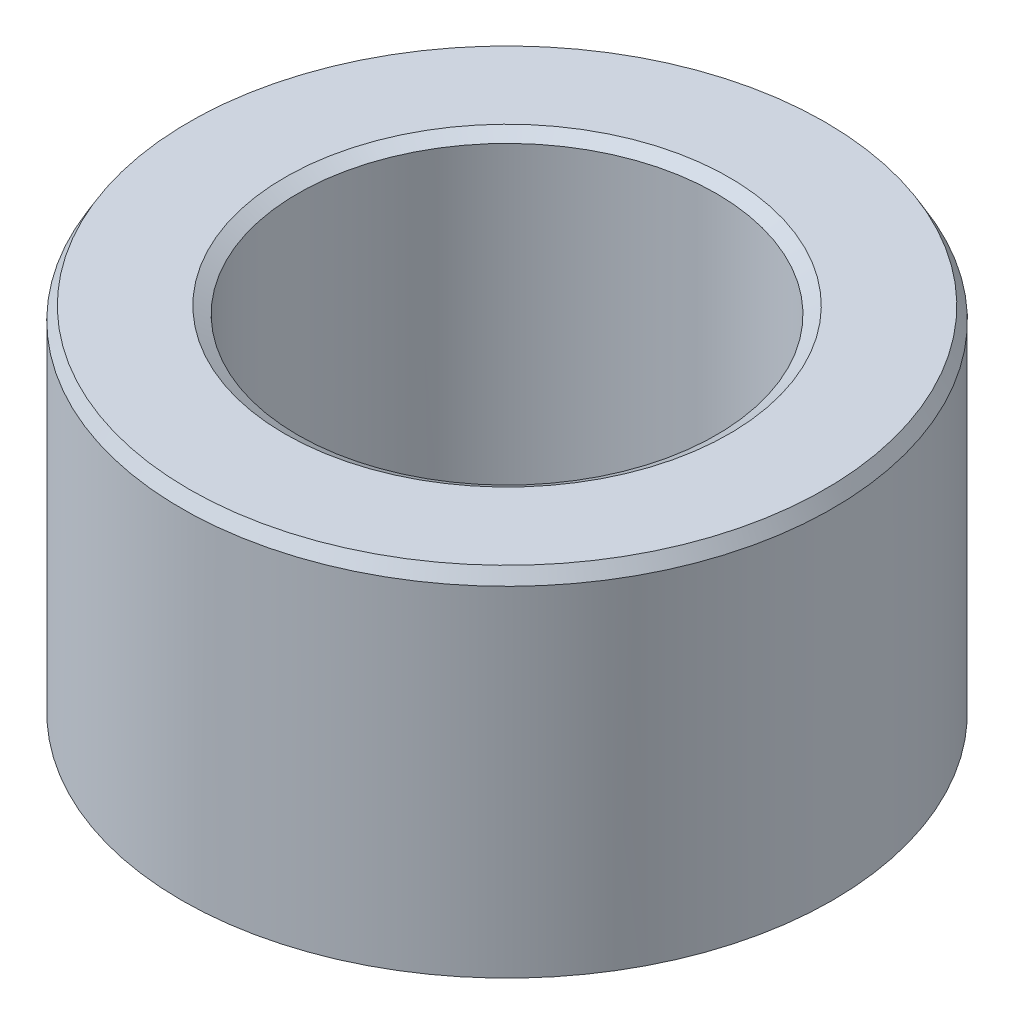
ISO-10303-21;
HEADER;
FILE_DESCRIPTION(('STEP AP214'),'2;1');
FILE_NAME('part.step','',(''),(''),'','','');
FILE_SCHEMA(('AUTOMOTIVE_DESIGN { 1 0 10303 214 1 1 1 1 }'));
ENDSEC;
DATA;
#1=APPLICATION_CONTEXT('core data for automotive mechanical design processes');
#2=APPLICATION_PROTOCOL_DEFINITION('international standard','automotive_design',2000,#1);
#3=PRODUCT_CONTEXT('',#1,'mechanical');
#4=PRODUCT('Part','Part','',(#3));
#5=PRODUCT_RELATED_PRODUCT_CATEGORY('part','',(#4));
#6=PRODUCT_DEFINITION_FORMATION('','',#4);
#7=PRODUCT_DEFINITION_CONTEXT('part definition',#1,'design');
#8=PRODUCT_DEFINITION('design','',#6,#7);
#9=PRODUCT_DEFINITION_SHAPE('','',#8);
#10=(LENGTH_UNIT() NAMED_UNIT(*) SI_UNIT(.MILLI.,.METRE.));
#11=(NAMED_UNIT(*) PLANE_ANGLE_UNIT() SI_UNIT($,.RADIAN.));
#12=(NAMED_UNIT(*) SI_UNIT($,.STERADIAN.) SOLID_ANGLE_UNIT());
#13=UNCERTAINTY_MEASURE_WITH_UNIT(LENGTH_MEASURE(1.E-05),#10,'distance_accuracy_value','');
#14=(GEOMETRIC_REPRESENTATION_CONTEXT(3) GLOBAL_UNCERTAINTY_ASSIGNED_CONTEXT((#13)) GLOBAL_UNIT_ASSIGNED_CONTEXT((#10,
#11,#12)) REPRESENTATION_CONTEXT('',''));
#15=CARTESIAN_POINT('',(0.,0.,0.));
#16=DIRECTION('',(0.,0.,1.));
#17=DIRECTION('',(1.,0.,0.));
#18=AXIS2_PLACEMENT_3D('',#15,#16,#17);
#19=CARTESIAN_POINT('',(0.,33.1529175196933,0.));
#20=DIRECTION('',(0.,-1.,0.));
#21=DIRECTION('',(0.,0.,-1.));
#22=AXIS2_PLACEMENT_3D('',#19,#20,#21);
#23=CYLINDRICAL_SURFACE('',#22,30.);
#24=CARTESIAN_POINT('',(0.,0.688393623580863,0.));
#25=DIRECTION('',(0.,1.,0.));
#26=DIRECTION('',(0.,0.,1.));
#27=AXIS2_PLACEMENT_3D('',#24,#25,#26);
#28=CIRCLE('',#27,30.);
#29=CARTESIAN_POINT('',(0.,0.688393623580863,-30.));
#30=VERTEX_POINT('',#29);
#31=EDGE_CURVE('E10',#30,#30,#28,.T.);
#32=CARTESIAN_POINT('',(0.,31.960584788045,0.));
#33=DIRECTION('',(0.,1.,0.));
#34=DIRECTION('',(0.,0.,1.));
#35=AXIS2_PLACEMENT_3D('',#32,#33,#34);
#36=CIRCLE('',#35,30.);
#37=CARTESIAN_POINT('',(0.,31.960584788045,-30.));
#38=VERTEX_POINT('',#37);
#39=EDGE_CURVE('E50',#38,#38,#36,.F.);
#40=CARTESIAN_POINT('',(0.,0.688393623580863,-30.));
#41=CARTESIAN_POINT('',(0.,1.01414561487737,-30.));
#42=CARTESIAN_POINT('',(0.,1.33989760617387,-30.));
#43=CARTESIAN_POINT('',(0.,1.99140158876687,-30.));
#44=CARTESIAN_POINT('',(0.,2.31715358006337,-30.));
#45=CARTESIAN_POINT('',(0.,2.96865756265637,-30.));
#46=CARTESIAN_POINT('',(0.,3.29440955395287,-30.));
#47=CARTESIAN_POINT('',(0.,3.94591353654588,-30.));
#48=CARTESIAN_POINT('',(0.,4.27166552784238,-30.));
#49=CARTESIAN_POINT('',(0.,4.92316951043538,-30.));
#50=CARTESIAN_POINT('',(0.,5.24892150173188,-30.));
#51=CARTESIAN_POINT('',(0.,5.90042548432488,-30.));
#52=CARTESIAN_POINT('',(0.,6.22617747562139,-30.));
#53=CARTESIAN_POINT('',(0.,6.87768145821439,-30.));
#54=CARTESIAN_POINT('',(0.,7.20343344951089,-30.));
#55=CARTESIAN_POINT('',(0.,7.85493743210389,-30.));
#56=CARTESIAN_POINT('',(0.,8.18068942340039,-30.));
#57=CARTESIAN_POINT('',(0.,8.8321934059934,-30.));
#58=CARTESIAN_POINT('',(0.,9.1579453972899,-30.));
#59=CARTESIAN_POINT('',(0.,9.8094493798829,-30.));
#60=CARTESIAN_POINT('',(0.,10.1352013711794,-30.));
#61=CARTESIAN_POINT('',(0.,10.7867053537724,-30.));
#62=CARTESIAN_POINT('',(0.,11.1124573450689,-30.));
#63=CARTESIAN_POINT('',(0.,11.7639613276619,-30.));
#64=CARTESIAN_POINT('',(0.,12.0897133189584,-30.));
#65=CARTESIAN_POINT('',(0.,12.7412173015514,-30.));
#66=CARTESIAN_POINT('',(0.,13.0669692928479,-30.));
#67=CARTESIAN_POINT('',(0.,13.7184732754409,-30.));
#68=CARTESIAN_POINT('',(0.,14.0442252667374,-30.));
#69=CARTESIAN_POINT('',(0.,14.6957292493304,-30.));
#70=CARTESIAN_POINT('',(0.,15.0214812406269,-30.));
#71=CARTESIAN_POINT('',(0.,15.6729852232199,-30.));
#72=CARTESIAN_POINT('',(0.,15.9987372145164,-30.));
#73=CARTESIAN_POINT('',(0.,16.6502411971094,-30.));
#74=CARTESIAN_POINT('',(0.,16.9759931884059,-30.));
#75=CARTESIAN_POINT('',(0.,17.6274971709989,-30.));
#76=CARTESIAN_POINT('',(0.,17.9532491622954,-30.));
#77=CARTESIAN_POINT('',(0.,18.6047531448884,-30.));
#78=CARTESIAN_POINT('',(0.,18.9305051361849,-30.));
#79=CARTESIAN_POINT('',(0.,19.5820091187779,-30.));
#80=CARTESIAN_POINT('',(0.,19.9077611100744,-30.));
#81=CARTESIAN_POINT('',(0.,20.5592650926674,-30.));
#82=CARTESIAN_POINT('',(0.,20.8850170839639,-30.));
#83=CARTESIAN_POINT('',(0.,21.536521066557,-30.));
#84=CARTESIAN_POINT('',(0.,21.8622730578535,-30.));
#85=CARTESIAN_POINT('',(0.,22.5137770404465,-30.));
#86=CARTESIAN_POINT('',(0.,22.839529031743,-30.));
#87=CARTESIAN_POINT('',(0.,23.491033014336,-30.));
#88=CARTESIAN_POINT('',(0.,23.8167850056325,-30.));
#89=CARTESIAN_POINT('',(0.,24.4682889882255,-30.));
#90=CARTESIAN_POINT('',(0.,24.794040979522,-30.));
#91=CARTESIAN_POINT('',(0.,25.445544962115,-30.));
#92=CARTESIAN_POINT('',(0.,25.7712969534115,-30.));
#93=CARTESIAN_POINT('',(0.,26.4228009360045,-30.));
#94=CARTESIAN_POINT('',(0.,26.748552927301,-30.));
#95=CARTESIAN_POINT('',(0.,27.400056909894,-30.));
#96=CARTESIAN_POINT('',(0.,27.7258089011905,-30.));
#97=CARTESIAN_POINT('',(0.,28.3773128837835,-30.));
#98=CARTESIAN_POINT('',(0.,28.70306487508,-30.));
#99=CARTESIAN_POINT('',(0.,29.354568857673,-30.));
#100=CARTESIAN_POINT('',(0.,29.6803208489695,-30.));
#101=CARTESIAN_POINT('',(0.,30.3318248315625,-30.));
#102=CARTESIAN_POINT('',(0.,30.657576822859,-30.));
#103=CARTESIAN_POINT('',(0.,31.309080805452,-30.));
#104=CARTESIAN_POINT('',(0.,31.6348327967485,-30.));
#105=CARTESIAN_POINT('',(0.,31.960584788045,-30.));
#106=B_SPLINE_CURVE_WITH_KNOTS('',3,(#40,#41,#42,#43,#44,#45,#46,#47,#48,#49,#50,#51,#52,#53,
#54,#55,#56,#57,#58,#59,#60,#61,#62,#63,#64,#65,#66,#67,#68,#69,#70,#71,#72,#73,#74,#75,#76,#77,
#78,#79,#80,#81,#82,#83,#84,#85,#86,#87,#88,#89,#90,#91,#92,#93,#94,#95,#96,#97,#98,#99,#100,
#101,#102,#103,#104,#105),.UNSPECIFIED.,.F.,.F.,(4,2,2,2,2,2,2,2,2,2,2,2,2,2,2,2,2,2,2,2,2,2,2,
2,2,2,2,2,2,2,2,2,4),(0.,0.977255973889507,1.954511947779,2.93176792166851,3.90902389555801,
4.88627986944752,5.86353584333702,6.84079181722653,7.81804779111603,8.79530376500554,
9.77255973889504,10.7498157127845,11.727071686674,12.7043276605636,13.6815836344531,
14.6588396083426,15.6360955822321,16.6133515561216,17.5906075300111,18.5678635039006,
19.5451194777901,20.5223754516796,21.4996314255691,22.4768873994586,23.4541433733481,
24.4313993472376,25.4086553211271,26.3859112950166,27.3631672689061,28.3404232427956,
29.3176792166851,30.2949351905746,31.2721911644641),.UNSPECIFIED.);
#107=EDGE_CURVE('BSEAM39',#30,#38,#106,.T.);
#108=ORIENTED_EDGE('',*,*,#31,.T.);
#109=ORIENTED_EDGE('',*,*,#39,.T.);
#110=ORIENTED_EDGE('',*,*,#107,.T.);
#111=ORIENTED_EDGE('',*,*,#107,.F.);
#112=EDGE_LOOP('',(#108,#110,#109,#111));
#113=FACE_BOUND('',#112,.T.);
#114=ADVANCED_FACE('F39',(#113),#23,.T.);
#115=CARTESIAN_POINT('',(0.,33.1529175196933,0.));
#116=DIRECTION('',(0.,1.,0.));
#117=DIRECTION('',(0.,0.,1.));
#118=AXIS2_PLACEMENT_3D('',#115,#116,#117);
#119=PLANE('',#118);
#120=CARTESIAN_POINT('',(0.,33.1529175196933,0.));
#121=DIRECTION('',(0.,1.,0.));
#122=DIRECTION('',(0.,0.,1.));
#123=AXIS2_PLACEMENT_3D('',#120,#121,#122);
#124=CIRCLE('',#123,20.4785011570187);
#125=CARTESIAN_POINT('',(0.,33.1529175196933,20.4785011570187));
#126=VERTEX_POINT('',#125);
#127=EDGE_CURVE('E58',#126,#126,#124,.F.);
#128=ORIENTED_EDGE('',*,*,#127,.T.);
#129=EDGE_LOOP('',(#128));
#130=FACE_BOUND('',#129,.T.);
#131=CARTESIAN_POINT('',(0.,33.1529175196933,0.));
#132=DIRECTION('',(0.,1.,0.));
#133=DIRECTION('',(0.,0.,1.));
#134=AXIS2_PLACEMENT_3D('',#131,#132,#133);
#135=CIRCLE('',#134,29.3116063764192);
#136=CARTESIAN_POINT('',(0.,33.1529175196933,29.3116063764192));
#137=VERTEX_POINT('',#136);
#138=EDGE_CURVE('E61',#137,#137,#135,.T.);
#139=ORIENTED_EDGE('',*,*,#138,.T.);
#140=EDGE_LOOP('',(#139));
#141=FACE_BOUND('',#140,.T.);
#142=ADVANCED_FACE('F88',(#130,#141),#119,.T.);
#143=CARTESIAN_POINT('',(0.,0.,0.));
#144=DIRECTION('',(0.,1.,0.));
#145=DIRECTION('',(0.,0.,1.));
#146=AXIS2_PLACEMENT_3D('',#143,#144,#145);
#147=PLANE('',#146);
#148=CARTESIAN_POINT('',(0.,0.,0.));
#149=DIRECTION('',(0.,1.,0.));
#150=DIRECTION('',(0.,0.,1.));
#151=AXIS2_PLACEMENT_3D('',#148,#149,#150);
#152=CIRCLE('',#151,19.974562048951);
#153=CARTESIAN_POINT('',(0.,0.,19.974562048951));
#154=VERTEX_POINT('',#153);
#155=EDGE_CURVE('E51',#154,#154,#152,.T.);
#156=ORIENTED_EDGE('',*,*,#155,.T.);
#157=EDGE_LOOP('',(#156));
#158=FACE_BOUND('',#157,.T.);
#159=CARTESIAN_POINT('',(0.,0.,0.));
#160=DIRECTION('',(0.,1.,0.));
#161=DIRECTION('',(0.,0.,1.));
#162=AXIS2_PLACEMENT_3D('',#159,#160,#161);
#163=CIRCLE('',#162,28.8076672683515);
#164=CARTESIAN_POINT('',(0.,0.,28.8076672683515));
#165=VERTEX_POINT('',#164);
#166=EDGE_CURVE('E54',#165,#165,#163,.F.);
#167=ORIENTED_EDGE('',*,*,#166,.T.);
#168=EDGE_LOOP('',(#167));
#169=FACE_BOUND('',#168,.T.);
#170=ADVANCED_FACE('F83',(#158,#169),#147,.F.);
#171=CARTESIAN_POINT('',(0.,33.1529175196933,0.));
#172=DIRECTION('',(0.,-1.,0.));
#173=DIRECTION('',(0.,0.,-1.));
#174=AXIS2_PLACEMENT_3D('',#171,#172,#173);
#175=CYLINDRICAL_SURFACE('',#174,19.2861684253702);
#176=CARTESIAN_POINT('',(0.,32.4645238961125,0.));
#177=DIRECTION('',(0.,1.,0.));
#178=DIRECTION('',(0.,0.,1.));
#179=AXIS2_PLACEMENT_3D('',#176,#177,#178);
#180=CIRCLE('',#179,19.2861684253702);
#181=CARTESIAN_POINT('',(0.,32.4645238961125,-19.2861684253702));
#182=VERTEX_POINT('',#181);
#183=EDGE_CURVE('E67',#182,#182,#180,.T.);
#184=CARTESIAN_POINT('',(0.,1.19233273164838,0.));
#185=DIRECTION('',(0.,1.,0.));
#186=DIRECTION('',(0.,0.,1.));
#187=AXIS2_PLACEMENT_3D('',#184,#185,#186);
#188=CIRCLE('',#187,19.2861684253702);
#189=CARTESIAN_POINT('',(0.,1.19233273164837,-19.2861684253702));
#190=VERTEX_POINT('',#189);
#191=EDGE_CURVE('E69',#190,#190,#188,.F.);
#192=CARTESIAN_POINT('',(0.,32.4645238961125,-19.2861684253702));
#193=CARTESIAN_POINT('',(0.,32.1387719048159,-19.2861684253702));
#194=CARTESIAN_POINT('',(0.,31.8130199135195,-19.2861684253702));
#195=CARTESIAN_POINT('',(0.,31.1615159309265,-19.2861684253702));
#196=CARTESIAN_POINT('',(0.,30.8357639396299,-19.2861684253702));
#197=CARTESIAN_POINT('',(0.,30.1842599570369,-19.2861684253702));
#198=CARTESIAN_POINT('',(0.,29.8585079657404,-19.2861684253702));
#199=CARTESIAN_POINT('',(0.,29.2070039831474,-19.2861684253702));
#200=CARTESIAN_POINT('',(0.,28.8812519918509,-19.2861684253702));
#201=CARTESIAN_POINT('',(0.,28.2297480092579,-19.2861684253702));
#202=CARTESIAN_POINT('',(0.,27.9039960179614,-19.2861684253702));
#203=CARTESIAN_POINT('',(0.,27.2524920353684,-19.2861684253702));
#204=CARTESIAN_POINT('',(0.,26.9267400440719,-19.2861684253702));
#205=CARTESIAN_POINT('',(0.,26.2752360614789,-19.2861684253702));
#206=CARTESIAN_POINT('',(0.,25.9494840701824,-19.2861684253702));
#207=CARTESIAN_POINT('',(0.,25.2979800875894,-19.2861684253702));
#208=CARTESIAN_POINT('',(0.,24.9722280962929,-19.2861684253702));
#209=CARTESIAN_POINT('',(0.,24.3207241136999,-19.2861684253702));
#210=CARTESIAN_POINT('',(0.,23.9949721224034,-19.2861684253702));
#211=CARTESIAN_POINT('',(0.,23.3434681398104,-19.2861684253702));
#212=CARTESIAN_POINT('',(0.,23.0177161485139,-19.2861684253702));
#213=CARTESIAN_POINT('',(0.,22.3662121659209,-19.2861684253702));
#214=CARTESIAN_POINT('',(0.,22.0404601746244,-19.2861684253702));
#215=CARTESIAN_POINT('',(0.,21.3889561920314,-19.2861684253702));
#216=CARTESIAN_POINT('',(0.,21.0632042007349,-19.2861684253702));
#217=CARTESIAN_POINT('',(0.,20.4117002181419,-19.2861684253702));
#218=CARTESIAN_POINT('',(0.,20.0859482268454,-19.2861684253702));
#219=CARTESIAN_POINT('',(0.,19.4344442442524,-19.2861684253702));
#220=CARTESIAN_POINT('',(0.,19.1086922529559,-19.2861684253702));
#221=CARTESIAN_POINT('',(0.,18.4571882703629,-19.2861684253702));
#222=CARTESIAN_POINT('',(0.,18.1314362790664,-19.2861684253702));
#223=CARTESIAN_POINT('',(0.,17.4799322964734,-19.2861684253702));
#224=CARTESIAN_POINT('',(0.,17.1541803051769,-19.2861684253702));
#225=CARTESIAN_POINT('',(0.,16.5026763225839,-19.2861684253702));
#226=CARTESIAN_POINT('',(0.,16.1769243312874,-19.2861684253702));
#227=CARTESIAN_POINT('',(0.,15.5254203486944,-19.2861684253702));
#228=CARTESIAN_POINT('',(0.,15.1996683573979,-19.2861684253702));
#229=CARTESIAN_POINT('',(0.,14.5481643748049,-19.2861684253702));
#230=CARTESIAN_POINT('',(0.,14.2224123835084,-19.2861684253702));
#231=CARTESIAN_POINT('',(0.,13.5709084009154,-19.2861684253702));
#232=CARTESIAN_POINT('',(0.,13.2451564096189,-19.2861684253702));
#233=CARTESIAN_POINT('',(0.,12.5936524270259,-19.2861684253702));
#234=CARTESIAN_POINT('',(0.,12.2679004357294,-19.2861684253702));
#235=CARTESIAN_POINT('',(0.,11.6163964531364,-19.2861684253702));
#236=CARTESIAN_POINT('',(0.,11.2906444618399,-19.2861684253702));
#237=CARTESIAN_POINT('',(0.,10.6391404792469,-19.2861684253702));
#238=CARTESIAN_POINT('',(0.,10.3133884879504,-19.2861684253702));
#239=CARTESIAN_POINT('',(0.,9.6618845053574,-19.2861684253702));
#240=CARTESIAN_POINT('',(0.,9.33613251406089,-19.2861684253702));
#241=CARTESIAN_POINT('',(0.,8.68462853146789,-19.2861684253702));
#242=CARTESIAN_POINT('',(0.,8.35887654017139,-19.2861684253702));
#243=CARTESIAN_POINT('',(0.,7.70737255757839,-19.2861684253702));
#244=CARTESIAN_POINT('',(0.,7.38162056628189,-19.2861684253702));
#245=CARTESIAN_POINT('',(0.,6.73011658368889,-19.2861684253702));
#246=CARTESIAN_POINT('',(0.,6.40436459239239,-19.2861684253702));
#247=CARTESIAN_POINT('',(0.,5.75286060979938,-19.2861684253702));
#248=CARTESIAN_POINT('',(0.,5.42710861850288,-19.2861684253702));
#249=CARTESIAN_POINT('',(0.,4.77560463590988,-19.2861684253702));
#250=CARTESIAN_POINT('',(0.,4.44985264461338,-19.2861684253702));
#251=CARTESIAN_POINT('',(0.,3.79834866202038,-19.2861684253702));
#252=CARTESIAN_POINT('',(0.,3.47259667072388,-19.2861684253702));
#253=CARTESIAN_POINT('',(0.,2.82109268813088,-19.2861684253702));
#254=CARTESIAN_POINT('',(0.,2.49534069683438,-19.2861684253702));
#255=CARTESIAN_POINT('',(0.,1.84383671424137,-19.2861684253702));
#256=CARTESIAN_POINT('',(0.,1.51808472294487,-19.2861684253702));
#257=CARTESIAN_POINT('',(0.,1.19233273164837,-19.2861684253702));
#258=B_SPLINE_CURVE_WITH_KNOTS('',3,(#192,#193,#194,#195,#196,#197,#198,#199,#200,#201,#202,
#203,#204,#205,#206,#207,#208,#209,#210,#211,#212,#213,#214,#215,#216,#217,#218,#219,#220,#221,
#222,#223,#224,#225,#226,#227,#228,#229,#230,#231,#232,#233,#234,#235,#236,#237,#238,#239,#240,
#241,#242,#243,#244,#245,#246,#247,#248,#249,#250,#251,#252,#253,#254,#255,#256,#257),
.UNSPECIFIED.,.F.,.F.,(4,2,2,2,2,2,2,2,2,2,2,2,2,2,2,2,2,2,2,2,2,2,2,2,2,2,2,2,2,2,2,2,4),(0.,
0.9772559738895,1.954511947779,2.9317679216685,3.90902389555801,4.88627986944751,
5.86353584333701,6.84079181722651,7.81804779111601,8.79530376500552,9.77255973889502,
10.7498157127845,11.727071686674,12.7043276605635,13.681583634453,14.6588396083425,
15.636095582232,16.6133515561215,17.590607530011,18.5678635039005,19.54511947779,
20.5223754516796,21.499631425569,22.4768873994586,23.4541433733481,24.4313993472376,
25.4086553211271,26.3859112950166,27.3631672689061,28.3404232427956,29.3176792166851,
30.2949351905746,31.2721911644641),.UNSPECIFIED.);
#259=EDGE_CURVE('BSEAM71',#182,#190,#258,.T.);
#260=ORIENTED_EDGE('',*,*,#183,.T.);
#261=ORIENTED_EDGE('',*,*,#191,.T.);
#262=ORIENTED_EDGE('',*,*,#259,.T.);
#263=ORIENTED_EDGE('',*,*,#259,.F.);
#264=EDGE_LOOP('',(#260,#262,#261,#263));
#265=FACE_BOUND('',#264,.T.);
#266=ADVANCED_FACE('F71',(#265),#175,.F.);
#267=CARTESIAN_POINT('',(0.,32.4645238961125,0.));
#268=DIRECTION('',(0.,1.,0.));
#269=DIRECTION('',(0.,0.,1.));
#270=AXIS2_PLACEMENT_3D('',#267,#268,#269);
#271=CONICAL_SURFACE('',#270,19.2861684253702,1.0471975511966);
#272=ORIENTED_EDGE('',*,*,#127,.F.);
#273=EDGE_LOOP('',(#272));
#274=FACE_BOUND('',#273,.T.);
#275=ORIENTED_EDGE('',*,*,#183,.F.);
#276=EDGE_LOOP('',(#275));
#277=FACE_BOUND('',#276,.T.);
#278=ADVANCED_FACE('F77',(#274,#277),#271,.F.);
#279=CARTESIAN_POINT('',(0.,0.,0.));
#280=DIRECTION('',(0.,-1.,0.));
#281=DIRECTION('',(0.,0.,-1.));
#282=AXIS2_PLACEMENT_3D('',#279,#280,#281);
#283=CONICAL_SURFACE('',#282,19.974562048951,0.523598775598299);
#284=ORIENTED_EDGE('',*,*,#191,.F.);
#285=EDGE_LOOP('',(#284));
#286=FACE_BOUND('',#285,.T.);
#287=ORIENTED_EDGE('',*,*,#155,.F.);
#288=EDGE_LOOP('',(#287));
#289=FACE_BOUND('',#288,.T.);
#290=ADVANCED_FACE('F73',(#286,#289),#283,.F.);
#291=CARTESIAN_POINT('',(0.,0.688393623580856,0.));
#292=DIRECTION('',(0.,1.,0.));
#293=DIRECTION('',(0.,0.,1.));
#294=AXIS2_PLACEMENT_3D('',#291,#292,#293);
#295=CONICAL_SURFACE('',#294,30.,1.0471975511966);
#296=ORIENTED_EDGE('',*,*,#166,.F.);
#297=EDGE_LOOP('',(#296));
#298=FACE_BOUND('',#297,.T.);
#299=ORIENTED_EDGE('',*,*,#31,.F.);
#300=EDGE_LOOP('',(#299));
#301=FACE_BOUND('',#300,.T.);
#302=ADVANCED_FACE('F76',(#298,#301),#295,.T.);
#303=CARTESIAN_POINT('',(0.,33.1529175196933,0.));
#304=DIRECTION('',(0.,-1.,0.));
#305=DIRECTION('',(0.,0.,-1.));
#306=AXIS2_PLACEMENT_3D('',#303,#304,#305);
#307=CONICAL_SURFACE('',#306,29.3116063764192,0.523598775598302);
#308=ORIENTED_EDGE('',*,*,#39,.F.);
#309=EDGE_LOOP('',(#308));
#310=FACE_BOUND('',#309,.T.);
#311=ORIENTED_EDGE('',*,*,#138,.F.);
#312=EDGE_LOOP('',(#311));
#313=FACE_BOUND('',#312,.T.);
#314=ADVANCED_FACE('F45',(#310,#313),#307,.T.);
#315=CLOSED_SHELL('',(#114,#142,#170,#266,#278,#290,#302,#314));
#316=MANIFOLD_SOLID_BREP('B2',#315);
#317=ADVANCED_BREP_SHAPE_REPRESENTATION('',(#18,#316),#14);
#318=SHAPE_DEFINITION_REPRESENTATION(#9,#317);
ENDSEC;
END-ISO-10303-21;
